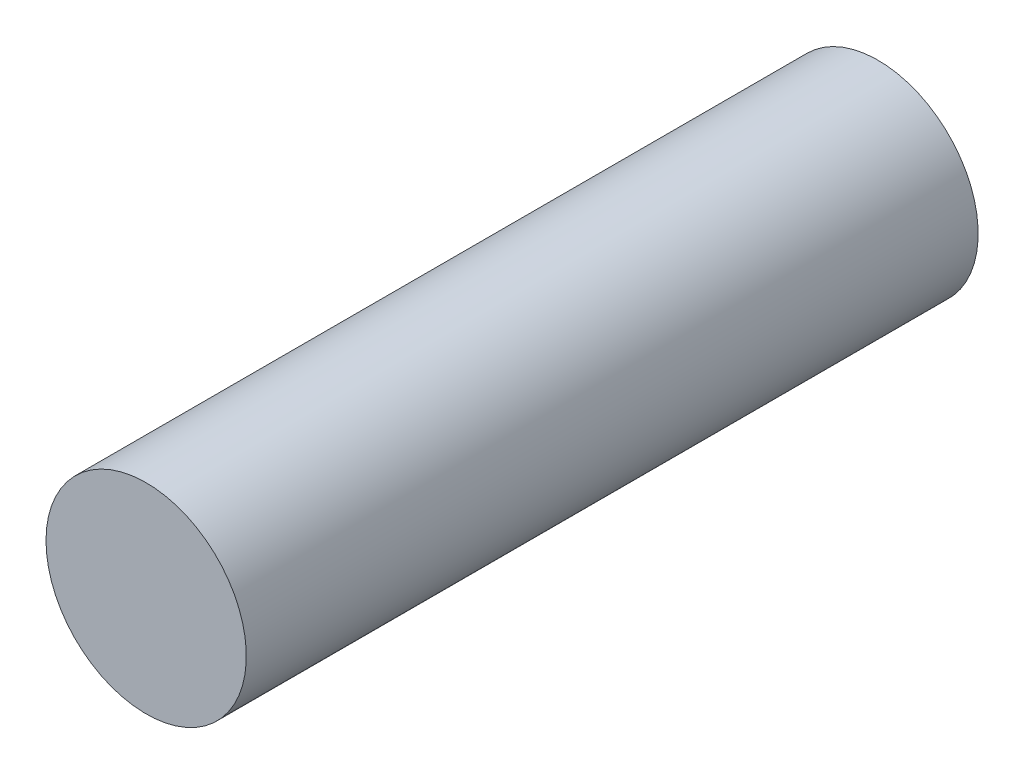
ISO-10303-21;
HEADER;
FILE_DESCRIPTION(('STEP AP214'),'2;1');
FILE_NAME('part.step','',(''),(''),'','','');
FILE_SCHEMA(('AUTOMOTIVE_DESIGN { 1 0 10303 214 1 1 1 1 }'));
ENDSEC;
DATA;
#1=APPLICATION_CONTEXT('core data for automotive mechanical design processes');
#2=APPLICATION_PROTOCOL_DEFINITION('international standard','automotive_design',2000,#1);
#3=PRODUCT_CONTEXT('',#1,'mechanical');
#4=PRODUCT('Part','Part','',(#3));
#5=PRODUCT_RELATED_PRODUCT_CATEGORY('part','',(#4));
#6=PRODUCT_DEFINITION_FORMATION('','',#4);
#7=PRODUCT_DEFINITION_CONTEXT('part definition',#1,'design');
#8=PRODUCT_DEFINITION('design','',#6,#7);
#9=PRODUCT_DEFINITION_SHAPE('','',#8);
#10=(LENGTH_UNIT() NAMED_UNIT(*) SI_UNIT(.MILLI.,.METRE.));
#11=(NAMED_UNIT(*) PLANE_ANGLE_UNIT() SI_UNIT($,.RADIAN.));
#12=(NAMED_UNIT(*) SI_UNIT($,.STERADIAN.) SOLID_ANGLE_UNIT());
#13=UNCERTAINTY_MEASURE_WITH_UNIT(LENGTH_MEASURE(1.E-05),#10,'distance_accuracy_value','');
#14=(GEOMETRIC_REPRESENTATION_CONTEXT(3) GLOBAL_UNCERTAINTY_ASSIGNED_CONTEXT((#13)) GLOBAL_UNIT_ASSIGNED_CONTEXT((#10,
#11,#12)) REPRESENTATION_CONTEXT('',''));
#15=CARTESIAN_POINT('',(0.,0.,0.));
#16=DIRECTION('',(0.,0.,1.));
#17=DIRECTION('',(1.,0.,0.));
#18=AXIS2_PLACEMENT_3D('',#15,#16,#17);
#19=CARTESIAN_POINT('',(0.,0.,149.5));
#20=DIRECTION('',(0.,0.,1.));
#21=DIRECTION('',(1.,0.,0.));
#22=AXIS2_PLACEMENT_3D('',#19,#20,#21);
#23=PLANE('',#22);
#24=CARTESIAN_POINT('',(0.,0.,149.5));
#25=DIRECTION('',(0.,0.,-1.));
#26=DIRECTION('',(-1.,0.,0.));
#27=AXIS2_PLACEMENT_3D('',#24,#25,#26);
#28=CIRCLE('',#27,37.5);
#29=CARTESIAN_POINT('',(-37.5,0.,149.5));
#30=VERTEX_POINT('',#29);
#31=EDGE_CURVE('E17',#30,#30,#28,.T.);
#32=ORIENTED_EDGE('',*,*,#31,.F.);
#33=EDGE_LOOP('',(#32));
#34=FACE_BOUND('',#33,.T.);
#35=ADVANCED_FACE('F14',(#34),#23,.T.);
#36=CARTESIAN_POINT('',(0.,37.5,-124.5));
#37=DIRECTION('',(0.,0.,-1.));
#38=DIRECTION('',(-1.,0.,0.));
#39=AXIS2_PLACEMENT_3D('',#36,#37,#38);
#40=PLANE('',#39);
#41=CARTESIAN_POINT('',(0.,0.,-124.5));
#42=DIRECTION('',(0.,0.,-1.));
#43=DIRECTION('',(-1.,0.,0.));
#44=AXIS2_PLACEMENT_3D('',#41,#42,#43);
#45=CIRCLE('',#44,37.5);
#46=CARTESIAN_POINT('',(-37.5,0.,-124.5));
#47=VERTEX_POINT('',#46);
#48=EDGE_CURVE('E10',#47,#47,#45,.F.);
#49=ORIENTED_EDGE('',*,*,#48,.F.);
#50=EDGE_LOOP('',(#49));
#51=FACE_BOUND('',#50,.T.);
#52=ADVANCED_FACE('F29',(#51),#40,.T.);
#53=CARTESIAN_POINT('',(0.,0.,149.5));
#54=DIRECTION('',(0.,0.,-1.));
#55=DIRECTION('',(-1.,0.,0.));
#56=AXIS2_PLACEMENT_3D('',#53,#54,#55);
#57=CYLINDRICAL_SURFACE('',#56,37.5);
#58=ORIENTED_EDGE('',*,*,#48,.T.);
#59=EDGE_LOOP('',(#58));
#60=FACE_BOUND('',#59,.T.);
#61=ORIENTED_EDGE('',*,*,#31,.T.);
#62=EDGE_LOOP('',(#61));
#63=FACE_BOUND('',#62,.T.);
#64=ADVANCED_FACE('F26',(#60,#63),#57,.T.);
#65=CLOSED_SHELL('',(#35,#52,#64));
#66=MANIFOLD_SOLID_BREP('B1',#65);
#67=ADVANCED_BREP_SHAPE_REPRESENTATION('',(#18,#66),#14);
#68=SHAPE_DEFINITION_REPRESENTATION(#9,#67);
ENDSEC;
END-ISO-10303-21;
